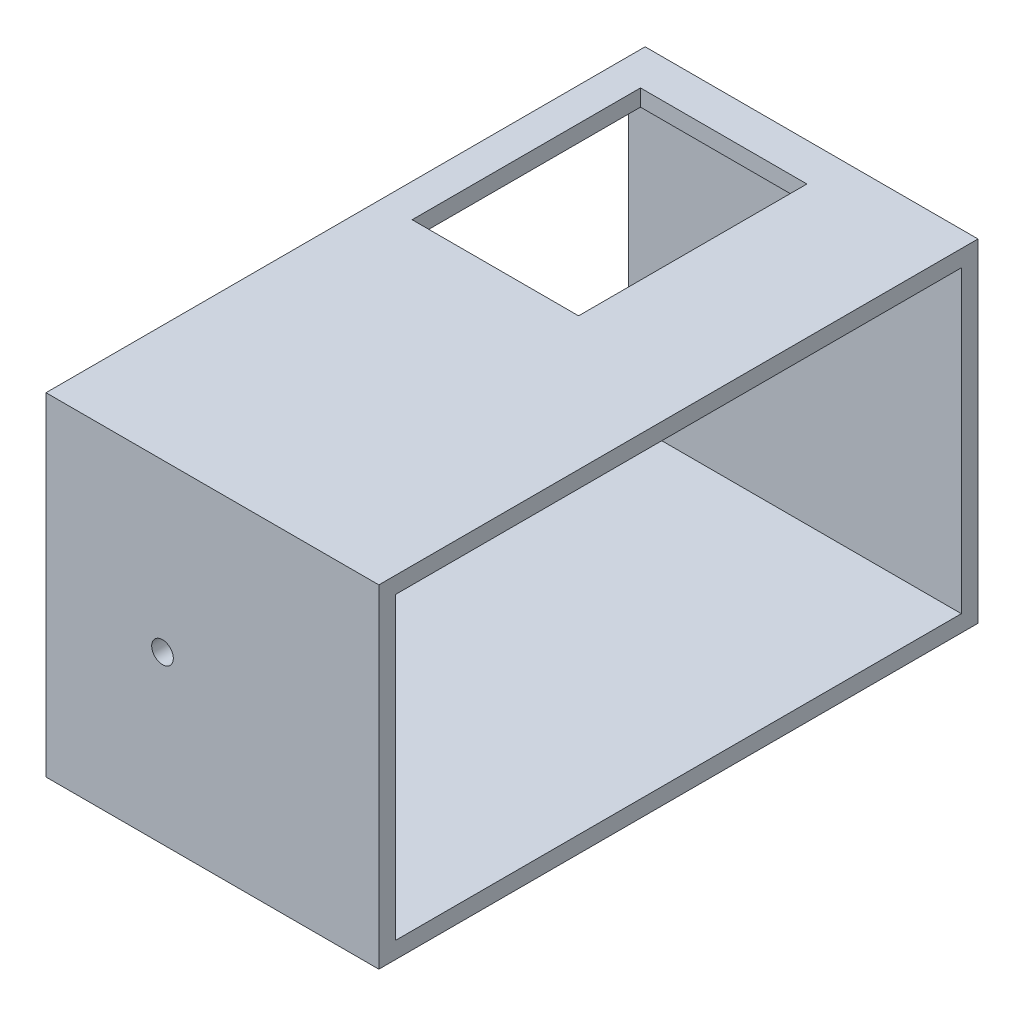
ISO-10303-21;
HEADER;
FILE_DESCRIPTION(('STEP AP214'),'2;1');
FILE_NAME('part.step','',(''),(''),'','','');
FILE_SCHEMA(('AUTOMOTIVE_DESIGN { 1 0 10303 214 1 1 1 1 }'));
ENDSEC;
DATA;
#1=APPLICATION_CONTEXT('core data for automotive mechanical design processes');
#2=APPLICATION_PROTOCOL_DEFINITION('international standard','automotive_design',2000,#1);
#3=PRODUCT_CONTEXT('',#1,'mechanical');
#4=PRODUCT('Part','Part','',(#3));
#5=PRODUCT_RELATED_PRODUCT_CATEGORY('part','',(#4));
#6=PRODUCT_DEFINITION_FORMATION('','',#4);
#7=PRODUCT_DEFINITION_CONTEXT('part definition',#1,'design');
#8=PRODUCT_DEFINITION('design','',#6,#7);
#9=PRODUCT_DEFINITION_SHAPE('','',#8);
#10=(LENGTH_UNIT() NAMED_UNIT(*) SI_UNIT(.MILLI.,.METRE.));
#11=(NAMED_UNIT(*) PLANE_ANGLE_UNIT() SI_UNIT($,.RADIAN.));
#12=(NAMED_UNIT(*) SI_UNIT($,.STERADIAN.) SOLID_ANGLE_UNIT());
#13=UNCERTAINTY_MEASURE_WITH_UNIT(LENGTH_MEASURE(1.E-05),#10,'distance_accuracy_value','');
#14=(GEOMETRIC_REPRESENTATION_CONTEXT(3) GLOBAL_UNCERTAINTY_ASSIGNED_CONTEXT((#13)) GLOBAL_UNIT_ASSIGNED_CONTEXT((#10,
#11,#12)) REPRESENTATION_CONTEXT('',''));
#15=CARTESIAN_POINT('',(0.,0.,0.));
#16=DIRECTION('',(0.,0.,1.));
#17=DIRECTION('',(1.,0.,0.));
#18=AXIS2_PLACEMENT_3D('',#15,#16,#17);
#19=CARTESIAN_POINT('',(50.,100.,-90.));
#20=DIRECTION('',(-1.,0.,0.));
#21=DIRECTION('',(0.,0.,1.));
#22=AXIS2_PLACEMENT_3D('',#19,#20,#21);
#23=PLANE('',#22);
#24=DIRECTION('',(0.,0.,-1.));
#25=VECTOR('',#24,1.);
#26=CARTESIAN_POINT('',(50.,95.,-85.));
#27=LINE('',#26,#25);
#28=CARTESIAN_POINT('',(50.,95.,85.));
#29=VERTEX_POINT('',#28);
#30=CARTESIAN_POINT('',(50.,95.,-85.));
#31=VERTEX_POINT('',#30);
#32=EDGE_CURVE('E134',#29,#31,#27,.T.);
#33=ORIENTED_EDGE('',*,*,#32,.T.);
#34=DIRECTION('',(0.,-1.,0.));
#35=VECTOR('',#34,1.);
#36=CARTESIAN_POINT('',(50.,95.,-85.));
#37=LINE('',#36,#35);
#38=CARTESIAN_POINT('',(50.,5.,-85.));
#39=VERTEX_POINT('',#38);
#40=EDGE_CURVE('E128',#31,#39,#37,.T.);
#41=ORIENTED_EDGE('',*,*,#40,.T.);
#42=DIRECTION('',(0.,0.,1.));
#43=VECTOR('',#42,1.);
#44=CARTESIAN_POINT('',(50.,5.,-85.));
#45=LINE('',#44,#43);
#46=CARTESIAN_POINT('',(50.,5.,85.));
#47=VERTEX_POINT('',#46);
#48=EDGE_CURVE('E137',#39,#47,#45,.T.);
#49=ORIENTED_EDGE('',*,*,#48,.T.);
#50=DIRECTION('',(0.,1.,0.));
#51=VECTOR('',#50,1.);
#52=CARTESIAN_POINT('',(50.,95.,85.));
#53=LINE('',#52,#51);
#54=EDGE_CURVE('E52',#47,#29,#53,.T.);
#55=ORIENTED_EDGE('',*,*,#54,.T.);
#56=EDGE_LOOP('',(#33,#41,#49,#55));
#57=FACE_BOUND('',#56,.T.);
#58=DIRECTION('',(0.,0.,-1.));
#59=VECTOR('',#58,1.);
#60=CARTESIAN_POINT('',(50.,0.,-90.));
#61=LINE('',#60,#59);
#62=CARTESIAN_POINT('',(50.,0.,90.));
#63=VERTEX_POINT('',#62);
#64=CARTESIAN_POINT('',(50.,0.,-90.));
#65=VERTEX_POINT('',#64);
#66=EDGE_CURVE('E188',#63,#65,#61,.T.);
#67=ORIENTED_EDGE('',*,*,#66,.T.);
#68=DIRECTION('',(0.,-1.,0.));
#69=VECTOR('',#68,1.);
#70=CARTESIAN_POINT('',(50.,100.,-90.));
#71=LINE('',#70,#69);
#72=CARTESIAN_POINT('',(50.,100.,-90.));
#73=VERTEX_POINT('',#72);
#74=EDGE_CURVE('E45',#73,#65,#71,.T.);
#75=ORIENTED_EDGE('',*,*,#74,.F.);
#76=DIRECTION('',(0.,0.,-1.));
#77=VECTOR('',#76,1.);
#78=CARTESIAN_POINT('',(50.,100.,-90.));
#79=LINE('',#78,#77);
#80=CARTESIAN_POINT('',(50.,100.,90.));
#81=VERTEX_POINT('',#80);
#82=EDGE_CURVE('E194',#81,#73,#79,.T.);
#83=ORIENTED_EDGE('',*,*,#82,.F.);
#84=DIRECTION('',(0.,-1.,0.));
#85=VECTOR('',#84,1.);
#86=CARTESIAN_POINT('',(50.,100.,90.));
#87=LINE('',#86,#85);
#88=EDGE_CURVE('E204',#81,#63,#87,.T.);
#89=ORIENTED_EDGE('',*,*,#88,.T.);
#90=EDGE_LOOP('',(#67,#75,#83,#89));
#91=FACE_BOUND('',#90,.T.);
#92=ADVANCED_FACE('F37',(#57,#91),#23,.F.);
#93=CARTESIAN_POINT('',(-50.,100.,-90.));
#94=DIRECTION('',(0.,0.,1.));
#95=DIRECTION('',(1.,0.,0.));
#96=AXIS2_PLACEMENT_3D('',#93,#94,#95);
#97=PLANE('',#96);
#98=CARTESIAN_POINT('',(-15.,50.,-90.));
#99=DIRECTION('',(0.,0.,1.));
#100=DIRECTION('',(1.,0.,0.));
#101=AXIS2_PLACEMENT_3D('',#98,#99,#100);
#102=CIRCLE('',#101,3.25);
#103=CARTESIAN_POINT('',(-11.75,50.,-90.));
#104=VERTEX_POINT('',#103);
#105=EDGE_CURVE('E266',#104,#104,#102,.T.);
#106=ORIENTED_EDGE('',*,*,#105,.T.);
#107=EDGE_LOOP('',(#106));
#108=FACE_BOUND('',#107,.T.);
#109=DIRECTION('',(-1.,0.,0.));
#110=VECTOR('',#109,1.);
#111=CARTESIAN_POINT('',(-50.,0.,-90.));
#112=LINE('',#111,#110);
#113=CARTESIAN_POINT('',(-50.,0.,-90.));
#114=VERTEX_POINT('',#113);
#115=EDGE_CURVE('E207',#65,#114,#112,.T.);
#116=ORIENTED_EDGE('',*,*,#115,.T.);
#117=DIRECTION('',(0.,-1.,0.));
#118=VECTOR('',#117,1.);
#119=CARTESIAN_POINT('',(-50.,100.,-90.));
#120=LINE('',#119,#118);
#121=CARTESIAN_POINT('',(-50.,100.,-90.));
#122=VERTEX_POINT('',#121);
#123=EDGE_CURVE('E217',#122,#114,#120,.T.);
#124=ORIENTED_EDGE('',*,*,#123,.F.);
#125=DIRECTION('',(-1.,0.,0.));
#126=VECTOR('',#125,1.);
#127=CARTESIAN_POINT('',(-50.,100.,-90.));
#128=LINE('',#127,#126);
#129=EDGE_CURVE('E197',#73,#122,#128,.T.);
#130=ORIENTED_EDGE('',*,*,#129,.F.);
#131=ORIENTED_EDGE('',*,*,#74,.T.);
#132=EDGE_LOOP('',(#116,#124,#130,#131));
#133=FACE_BOUND('',#132,.T.);
#134=ADVANCED_FACE('F223',(#108,#133),#97,.F.);
#135=CARTESIAN_POINT('',(-50.,100.,-90.));
#136=DIRECTION('',(1.,0.,0.));
#137=DIRECTION('',(0.,0.,-1.));
#138=AXIS2_PLACEMENT_3D('',#135,#136,#137);
#139=PLANE('',#138);
#140=DIRECTION('',(0.,0.,1.));
#141=VECTOR('',#140,1.);
#142=CARTESIAN_POINT('',(-50.,5.,-85.));
#143=LINE('',#142,#141);
#144=CARTESIAN_POINT('',(-50.,5.,-85.));
#145=VERTEX_POINT('',#144);
#146=CARTESIAN_POINT('',(-50.,5.,85.));
#147=VERTEX_POINT('',#146);
#148=EDGE_CURVE('E155',#145,#147,#143,.T.);
#149=ORIENTED_EDGE('',*,*,#148,.F.);
#150=DIRECTION('',(0.,-1.,0.));
#151=VECTOR('',#150,1.);
#152=CARTESIAN_POINT('',(-50.,95.,-85.));
#153=LINE('',#152,#151);
#154=CARTESIAN_POINT('',(-50.,95.,-85.));
#155=VERTEX_POINT('',#154);
#156=EDGE_CURVE('E60',#155,#145,#153,.T.);
#157=ORIENTED_EDGE('',*,*,#156,.F.);
#158=DIRECTION('',(0.,0.,-1.));
#159=VECTOR('',#158,1.);
#160=CARTESIAN_POINT('',(-50.,95.,-85.));
#161=LINE('',#160,#159);
#162=CARTESIAN_POINT('',(-50.,95.,85.));
#163=VERTEX_POINT('',#162);
#164=EDGE_CURVE('E143',#163,#155,#161,.T.);
#165=ORIENTED_EDGE('',*,*,#164,.F.);
#166=DIRECTION('',(0.,1.,0.));
#167=VECTOR('',#166,1.);
#168=CARTESIAN_POINT('',(-50.,95.,85.));
#169=LINE('',#168,#167);
#170=EDGE_CURVE('E146',#147,#163,#169,.T.);
#171=ORIENTED_EDGE('',*,*,#170,.F.);
#172=EDGE_LOOP('',(#149,#157,#165,#171));
#173=FACE_BOUND('',#172,.T.);
#174=DIRECTION('',(0.,0.,1.));
#175=VECTOR('',#174,1.);
#176=CARTESIAN_POINT('',(-50.,0.,-90.));
#177=LINE('',#176,#175);
#178=CARTESIAN_POINT('',(-50.,0.,90.));
#179=VERTEX_POINT('',#178);
#180=EDGE_CURVE('E209',#114,#179,#177,.T.);
#181=ORIENTED_EDGE('',*,*,#180,.T.);
#182=DIRECTION('',(0.,-1.,0.));
#183=VECTOR('',#182,1.);
#184=CARTESIAN_POINT('',(-50.,100.,90.));
#185=LINE('',#184,#183);
#186=CARTESIAN_POINT('',(-50.,100.,90.));
#187=VERTEX_POINT('',#186);
#188=EDGE_CURVE('E214',#187,#179,#185,.T.);
#189=ORIENTED_EDGE('',*,*,#188,.F.);
#190=DIRECTION('',(0.,0.,1.));
#191=VECTOR('',#190,1.);
#192=CARTESIAN_POINT('',(-50.,100.,-90.));
#193=LINE('',#192,#191);
#194=EDGE_CURVE('E200',#122,#187,#193,.T.);
#195=ORIENTED_EDGE('',*,*,#194,.F.);
#196=ORIENTED_EDGE('',*,*,#123,.T.);
#197=EDGE_LOOP('',(#181,#189,#195,#196));
#198=FACE_BOUND('',#197,.T.);
#199=ADVANCED_FACE('F234',(#173,#198),#139,.F.);
#200=CARTESIAN_POINT('',(-50.,100.,90.));
#201=DIRECTION('',(0.,0.,-1.));
#202=DIRECTION('',(-1.,0.,0.));
#203=AXIS2_PLACEMENT_3D('',#200,#201,#202);
#204=PLANE('',#203);
#205=CARTESIAN_POINT('',(-15.,50.,90.));
#206=DIRECTION('',(0.,0.,-1.));
#207=DIRECTION('',(-1.,0.,0.));
#208=AXIS2_PLACEMENT_3D('',#205,#206,#207);
#209=CIRCLE('',#208,3.25);
#210=CARTESIAN_POINT('',(-18.25,50.,90.));
#211=VERTEX_POINT('',#210);
#212=EDGE_CURVE('E149',#211,#211,#209,.T.);
#213=ORIENTED_EDGE('',*,*,#212,.T.);
#214=EDGE_LOOP('',(#213));
#215=FACE_BOUND('',#214,.T.);
#216=DIRECTION('',(1.,0.,0.));
#217=VECTOR('',#216,1.);
#218=CARTESIAN_POINT('',(-50.,0.,90.));
#219=LINE('',#218,#217);
#220=EDGE_CURVE('E198',#179,#63,#219,.T.);
#221=ORIENTED_EDGE('',*,*,#220,.T.);
#222=ORIENTED_EDGE('',*,*,#88,.F.);
#223=DIRECTION('',(1.,0.,0.));
#224=VECTOR('',#223,1.);
#225=CARTESIAN_POINT('',(-50.,100.,90.));
#226=LINE('',#225,#224);
#227=EDGE_CURVE('E202',#187,#81,#226,.T.);
#228=ORIENTED_EDGE('',*,*,#227,.F.);
#229=ORIENTED_EDGE('',*,*,#188,.T.);
#230=EDGE_LOOP('',(#221,#222,#228,#229));
#231=FACE_BOUND('',#230,.T.);
#232=ADVANCED_FACE('F238',(#215,#231),#204,.F.);
#233=CARTESIAN_POINT('',(0.,100.,0.));
#234=DIRECTION('',(0.,1.,0.));
#235=DIRECTION('',(0.,0.,1.));
#236=AXIS2_PLACEMENT_3D('',#233,#234,#235);
#237=PLANE('',#236);
#238=DIRECTION('',(0.,0.,1.));
#239=VECTOR('',#238,1.);
#240=CARTESIAN_POINT('',(-40.,100.,-78.6));
#241=LINE('',#240,#239);
#242=CARTESIAN_POINT('',(-40.,100.,-78.6));
#243=VERTEX_POINT('',#242);
#244=CARTESIAN_POINT('',(-40.,100.,-9.99999999999999));
#245=VERTEX_POINT('',#244);
#246=EDGE_CURVE('E173',#243,#245,#241,.T.);
#247=ORIENTED_EDGE('',*,*,#246,.F.);
#248=DIRECTION('',(-1.,0.,0.));
#249=VECTOR('',#248,1.);
#250=CARTESIAN_POINT('',(-40.,100.,-78.6));
#251=LINE('',#250,#249);
#252=CARTESIAN_POINT('',(9.99999999999999,100.,-78.6));
#253=VERTEX_POINT('',#252);
#254=EDGE_CURVE('E182',#253,#243,#251,.T.);
#255=ORIENTED_EDGE('',*,*,#254,.F.);
#256=DIRECTION('',(0.,0.,-1.));
#257=VECTOR('',#256,1.);
#258=CARTESIAN_POINT('',(9.99999999999999,100.,-78.6));
#259=LINE('',#258,#257);
#260=CARTESIAN_POINT('',(10.,100.,-9.99999999999999));
#261=VERTEX_POINT('',#260);
#262=EDGE_CURVE('E179',#261,#253,#259,.T.);
#263=ORIENTED_EDGE('',*,*,#262,.F.);
#264=DIRECTION('',(1.,0.,0.));
#265=VECTOR('',#264,1.);
#266=CARTESIAN_POINT('',(-40.,100.,-9.99999999999999));
#267=LINE('',#266,#265);
#268=EDGE_CURVE('E176',#245,#261,#267,.T.);
#269=ORIENTED_EDGE('',*,*,#268,.F.);
#270=EDGE_LOOP('',(#247,#255,#263,#269));
#271=FACE_BOUND('',#270,.T.);
#272=ORIENTED_EDGE('',*,*,#82,.T.);
#273=ORIENTED_EDGE('',*,*,#129,.T.);
#274=ORIENTED_EDGE('',*,*,#194,.T.);
#275=ORIENTED_EDGE('',*,*,#227,.T.);
#276=EDGE_LOOP('',(#272,#273,#274,#275));
#277=FACE_BOUND('',#276,.T.);
#278=ADVANCED_FACE('F240',(#271,#277),#237,.T.);
#279=CARTESIAN_POINT('',(0.,0.,0.));
#280=DIRECTION('',(0.,1.,0.));
#281=DIRECTION('',(0.,0.,1.));
#282=AXIS2_PLACEMENT_3D('',#279,#280,#281);
#283=PLANE('',#282);
#284=ORIENTED_EDGE('',*,*,#66,.F.);
#285=ORIENTED_EDGE('',*,*,#220,.F.);
#286=ORIENTED_EDGE('',*,*,#180,.F.);
#287=ORIENTED_EDGE('',*,*,#115,.F.);
#288=EDGE_LOOP('',(#284,#285,#286,#287));
#289=FACE_BOUND('',#288,.T.);
#290=ADVANCED_FACE('F230',(#289),#283,.F.);
#291=CARTESIAN_POINT('',(-40.,10.,-78.6));
#292=DIRECTION('',(-1.,0.,0.));
#293=DIRECTION('',(0.,0.,1.));
#294=AXIS2_PLACEMENT_3D('',#291,#292,#293);
#295=PLANE('',#294);
#296=DIRECTION('',(0.,1.,0.));
#297=VECTOR('',#296,1.);
#298=CARTESIAN_POINT('',(-40.,10.,-9.99999999999999));
#299=LINE('',#298,#297);
#300=CARTESIAN_POINT('',(-40.,95.,-9.99999999999999));
#301=VERTEX_POINT('',#300);
#302=EDGE_CURVE('E185',#301,#245,#299,.T.);
#303=ORIENTED_EDGE('',*,*,#302,.F.);
#304=DIRECTION('',(0.,0.,-1.));
#305=VECTOR('',#304,1.);
#306=CARTESIAN_POINT('',(-40.,95.,-78.6));
#307=LINE('',#306,#305);
#308=CARTESIAN_POINT('',(-40.,95.,-78.6));
#309=VERTEX_POINT('',#308);
#310=EDGE_CURVE('E170',#301,#309,#307,.T.);
#311=ORIENTED_EDGE('',*,*,#310,.T.);
#312=DIRECTION('',(0.,1.,0.));
#313=VECTOR('',#312,1.);
#314=CARTESIAN_POINT('',(-40.,10.,-78.6));
#315=LINE('',#314,#313);
#316=EDGE_CURVE('E186',#309,#243,#315,.T.);
#317=ORIENTED_EDGE('',*,*,#316,.T.);
#318=ORIENTED_EDGE('',*,*,#246,.T.);
#319=EDGE_LOOP('',(#303,#311,#317,#318));
#320=FACE_BOUND('',#319,.T.);
#321=ADVANCED_FACE('F248',(#320),#295,.F.);
#322=CARTESIAN_POINT('',(-40.,10.,-78.6));
#323=DIRECTION('',(0.,0.,-1.));
#324=DIRECTION('',(-1.,0.,0.));
#325=AXIS2_PLACEMENT_3D('',#322,#323,#324);
#326=PLANE('',#325);
#327=ORIENTED_EDGE('',*,*,#316,.F.);
#328=DIRECTION('',(1.,0.,0.));
#329=VECTOR('',#328,1.);
#330=CARTESIAN_POINT('',(-40.,95.,-78.6));
#331=LINE('',#330,#329);
#332=CARTESIAN_POINT('',(9.99999999999999,95.,-78.6));
#333=VERTEX_POINT('',#332);
#334=EDGE_CURVE('E167',#309,#333,#331,.T.);
#335=ORIENTED_EDGE('',*,*,#334,.T.);
#336=DIRECTION('',(0.,1.,0.));
#337=VECTOR('',#336,1.);
#338=CARTESIAN_POINT('',(9.99999999999999,10.,-78.6));
#339=LINE('',#338,#337);
#340=EDGE_CURVE('E189',#333,#253,#339,.T.);
#341=ORIENTED_EDGE('',*,*,#340,.T.);
#342=ORIENTED_EDGE('',*,*,#254,.T.);
#343=EDGE_LOOP('',(#327,#335,#341,#342));
#344=FACE_BOUND('',#343,.T.);
#345=ADVANCED_FACE('F300',(#344),#326,.F.);
#346=CARTESIAN_POINT('',(9.99999999999999,10.,-78.6));
#347=DIRECTION('',(1.,0.,0.));
#348=DIRECTION('',(0.,0.,-1.));
#349=AXIS2_PLACEMENT_3D('',#346,#347,#348);
#350=PLANE('',#349);
#351=ORIENTED_EDGE('',*,*,#340,.F.);
#352=DIRECTION('',(0.,0.,1.));
#353=VECTOR('',#352,1.);
#354=CARTESIAN_POINT('',(9.99999999999999,95.,-78.6));
#355=LINE('',#354,#353);
#356=CARTESIAN_POINT('',(10.,95.,-9.99999999999999));
#357=VERTEX_POINT('',#356);
#358=EDGE_CURVE('E161',#333,#357,#355,.T.);
#359=ORIENTED_EDGE('',*,*,#358,.T.);
#360=DIRECTION('',(0.,1.,0.));
#361=VECTOR('',#360,1.);
#362=CARTESIAN_POINT('',(10.,10.,-9.99999999999999));
#363=LINE('',#362,#361);
#364=EDGE_CURVE('E191',#357,#261,#363,.T.);
#365=ORIENTED_EDGE('',*,*,#364,.T.);
#366=ORIENTED_EDGE('',*,*,#262,.T.);
#367=EDGE_LOOP('',(#351,#359,#365,#366));
#368=FACE_BOUND('',#367,.T.);
#369=ADVANCED_FACE('F303',(#368),#350,.F.);
#370=CARTESIAN_POINT('',(-40.,10.,-9.99999999999999));
#371=DIRECTION('',(0.,0.,1.));
#372=DIRECTION('',(1.,0.,0.));
#373=AXIS2_PLACEMENT_3D('',#370,#371,#372);
#374=PLANE('',#373);
#375=ORIENTED_EDGE('',*,*,#364,.F.);
#376=DIRECTION('',(-1.,0.,0.));
#377=VECTOR('',#376,1.);
#378=CARTESIAN_POINT('',(-40.,95.,-9.99999999999999));
#379=LINE('',#378,#377);
#380=EDGE_CURVE('E11',#357,#301,#379,.T.);
#381=ORIENTED_EDGE('',*,*,#380,.T.);
#382=ORIENTED_EDGE('',*,*,#302,.T.);
#383=ORIENTED_EDGE('',*,*,#268,.T.);
#384=EDGE_LOOP('',(#375,#381,#382,#383));
#385=FACE_BOUND('',#384,.T.);
#386=ADVANCED_FACE('F293',(#385),#374,.F.);
#387=CARTESIAN_POINT('',(50.,95.,-85.));
#388=DIRECTION('',(0.,1.,0.));
#389=DIRECTION('',(0.,0.,1.));
#390=AXIS2_PLACEMENT_3D('',#387,#388,#389);
#391=PLANE('',#390);
#392=ORIENTED_EDGE('',*,*,#164,.T.);
#393=DIRECTION('',(-1.,0.,0.));
#394=VECTOR('',#393,1.);
#395=CARTESIAN_POINT('',(50.,95.,-85.));
#396=LINE('',#395,#394);
#397=EDGE_CURVE('E159',#31,#155,#396,.T.);
#398=ORIENTED_EDGE('',*,*,#397,.F.);
#399=ORIENTED_EDGE('',*,*,#32,.F.);
#400=DIRECTION('',(-1.,0.,0.));
#401=VECTOR('',#400,1.);
#402=CARTESIAN_POINT('',(50.,95.,85.));
#403=LINE('',#402,#401);
#404=EDGE_CURVE('E162',#29,#163,#403,.T.);
#405=ORIENTED_EDGE('',*,*,#404,.T.);
#406=EDGE_LOOP('',(#392,#398,#399,#405));
#407=FACE_BOUND('',#406,.T.);
#408=ORIENTED_EDGE('',*,*,#380,.F.);
#409=ORIENTED_EDGE('',*,*,#358,.F.);
#410=ORIENTED_EDGE('',*,*,#334,.F.);
#411=ORIENTED_EDGE('',*,*,#310,.F.);
#412=EDGE_LOOP('',(#408,#409,#410,#411));
#413=FACE_BOUND('',#412,.T.);
#414=ADVANCED_FACE('F290',(#407,#413),#391,.F.);
#415=CARTESIAN_POINT('',(50.,95.,-85.));
#416=DIRECTION('',(0.,0.,-1.));
#417=DIRECTION('',(-1.,0.,0.));
#418=AXIS2_PLACEMENT_3D('',#415,#416,#417);
#419=PLANE('',#418);
#420=CARTESIAN_POINT('',(-15.,50.,-85.));
#421=DIRECTION('',(0.,0.,-1.));
#422=DIRECTION('',(-1.,0.,0.));
#423=AXIS2_PLACEMENT_3D('',#420,#421,#422);
#424=CIRCLE('',#423,3.25);
#425=CARTESIAN_POINT('',(-18.25,50.,-85.));
#426=VERTEX_POINT('',#425);
#427=EDGE_CURVE('E270',#426,#426,#424,.T.);
#428=ORIENTED_EDGE('',*,*,#427,.T.);
#429=EDGE_LOOP('',(#428));
#430=FACE_BOUND('',#429,.T.);
#431=ORIENTED_EDGE('',*,*,#156,.T.);
#432=DIRECTION('',(-1.,0.,0.));
#433=VECTOR('',#432,1.);
#434=CARTESIAN_POINT('',(50.,5.,-85.));
#435=LINE('',#434,#433);
#436=EDGE_CURVE('E124',#39,#145,#435,.T.);
#437=ORIENTED_EDGE('',*,*,#436,.F.);
#438=ORIENTED_EDGE('',*,*,#40,.F.);
#439=ORIENTED_EDGE('',*,*,#397,.T.);
#440=EDGE_LOOP('',(#431,#437,#438,#439));
#441=FACE_BOUND('',#440,.T.);
#442=ADVANCED_FACE('F126',(#430,#441),#419,.F.);
#443=CARTESIAN_POINT('',(50.,95.,85.));
#444=DIRECTION('',(0.,0.,1.));
#445=DIRECTION('',(1.,0.,0.));
#446=AXIS2_PLACEMENT_3D('',#443,#444,#445);
#447=PLANE('',#446);
#448=CARTESIAN_POINT('',(-15.,50.,85.));
#449=DIRECTION('',(0.,0.,1.));
#450=DIRECTION('',(1.,0.,0.));
#451=AXIS2_PLACEMENT_3D('',#448,#449,#450);
#452=CIRCLE('',#451,3.25);
#453=CARTESIAN_POINT('',(-11.75,50.,85.));
#454=VERTEX_POINT('',#453);
#455=EDGE_CURVE('E40',#454,#454,#452,.T.);
#456=ORIENTED_EDGE('',*,*,#455,.T.);
#457=EDGE_LOOP('',(#456));
#458=FACE_BOUND('',#457,.T.);
#459=ORIENTED_EDGE('',*,*,#170,.T.);
#460=ORIENTED_EDGE('',*,*,#404,.F.);
#461=ORIENTED_EDGE('',*,*,#54,.F.);
#462=DIRECTION('',(-1.,0.,0.));
#463=VECTOR('',#462,1.);
#464=CARTESIAN_POINT('',(50.,5.,85.));
#465=LINE('',#464,#463);
#466=EDGE_CURVE('E133',#47,#147,#465,.T.);
#467=ORIENTED_EDGE('',*,*,#466,.T.);
#468=EDGE_LOOP('',(#459,#460,#461,#467));
#469=FACE_BOUND('',#468,.T.);
#470=ADVANCED_FACE('F286',(#458,#469),#447,.F.);
#471=CARTESIAN_POINT('',(50.,5.,-85.));
#472=DIRECTION('',(0.,-1.,0.));
#473=DIRECTION('',(0.,0.,-1.));
#474=AXIS2_PLACEMENT_3D('',#471,#472,#473);
#475=PLANE('',#474);
#476=ORIENTED_EDGE('',*,*,#148,.T.);
#477=ORIENTED_EDGE('',*,*,#466,.F.);
#478=ORIENTED_EDGE('',*,*,#48,.F.);
#479=ORIENTED_EDGE('',*,*,#436,.T.);
#480=EDGE_LOOP('',(#476,#477,#478,#479));
#481=FACE_BOUND('',#480,.T.);
#482=ADVANCED_FACE('F138',(#481),#475,.F.);
#483=CARTESIAN_POINT('',(-15.,50.,-90.));
#484=DIRECTION('',(0.,0.,1.));
#485=DIRECTION('',(1.,0.,0.));
#486=AXIS2_PLACEMENT_3D('',#483,#484,#485);
#487=CYLINDRICAL_SURFACE('',#486,3.25);
#488=ORIENTED_EDGE('',*,*,#455,.F.);
#489=EDGE_LOOP('',(#488));
#490=FACE_BOUND('',#489,.T.);
#491=ORIENTED_EDGE('',*,*,#212,.F.);
#492=EDGE_LOOP('',(#491));
#493=FACE_BOUND('',#492,.T.);
#494=ADVANCED_FACE('F277',(#490,#493),#487,.F.);
#495=ORIENTED_EDGE('',*,*,#105,.F.);
#496=EDGE_LOOP('',(#495));
#497=FACE_BOUND('',#496,.T.);
#498=ORIENTED_EDGE('',*,*,#427,.F.);
#499=EDGE_LOOP('',(#498));
#500=FACE_BOUND('',#499,.T.);
#501=ADVANCED_FACE('F279',(#497,#500),#487,.F.);
#502=CLOSED_SHELL('',(#92,#134,#199,#232,#278,#290,#321,#345,#369,#386,#414,#442,#470,#482,#494,#501));
#503=MANIFOLD_SOLID_BREP('B2',#502);
#504=ADVANCED_BREP_SHAPE_REPRESENTATION('',(#18,#503),#14);
#505=SHAPE_DEFINITION_REPRESENTATION(#9,#504);
ENDSEC;
END-ISO-10303-21;
